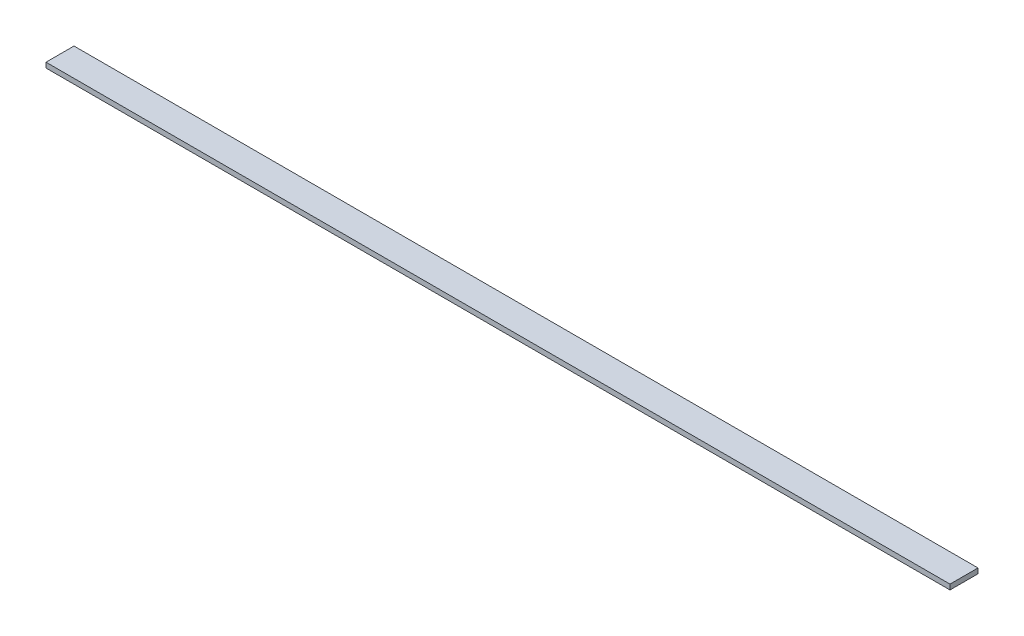
ISO-10303-21;
HEADER;
FILE_DESCRIPTION(('STEP AP214'),'2;1');
FILE_NAME('part.step','',(''),(''),'','','');
FILE_SCHEMA(('AUTOMOTIVE_DESIGN { 1 0 10303 214 1 1 1 1 }'));
ENDSEC;
DATA;
#1=APPLICATION_CONTEXT('core data for automotive mechanical design processes');
#2=APPLICATION_PROTOCOL_DEFINITION('international standard','automotive_design',2000,#1);
#3=PRODUCT_CONTEXT('',#1,'mechanical');
#4=PRODUCT('Part','Part','',(#3));
#5=PRODUCT_RELATED_PRODUCT_CATEGORY('part','',(#4));
#6=PRODUCT_DEFINITION_FORMATION('','',#4);
#7=PRODUCT_DEFINITION_CONTEXT('part definition',#1,'design');
#8=PRODUCT_DEFINITION('design','',#6,#7);
#9=PRODUCT_DEFINITION_SHAPE('','',#8);
#10=(LENGTH_UNIT() NAMED_UNIT(*) SI_UNIT(.MILLI.,.METRE.));
#11=(NAMED_UNIT(*) PLANE_ANGLE_UNIT() SI_UNIT($,.RADIAN.));
#12=(NAMED_UNIT(*) SI_UNIT($,.STERADIAN.) SOLID_ANGLE_UNIT());
#13=UNCERTAINTY_MEASURE_WITH_UNIT(LENGTH_MEASURE(1.E-05),#10,'distance_accuracy_value','');
#14=(GEOMETRIC_REPRESENTATION_CONTEXT(3) GLOBAL_UNCERTAINTY_ASSIGNED_CONTEXT((#13)) GLOBAL_UNIT_ASSIGNED_CONTEXT((#10,
#11,#12)) REPRESENTATION_CONTEXT('',''));
#15=CARTESIAN_POINT('',(0.,0.,0.));
#16=DIRECTION('',(0.,0.,1.));
#17=DIRECTION('',(1.,0.,0.));
#18=AXIS2_PLACEMENT_3D('',#15,#16,#17);
#19=CARTESIAN_POINT('',(0.,25.4,0.));
#20=DIRECTION('',(0.,0.,1.));
#21=DIRECTION('',(1.,0.,0.));
#22=AXIS2_PLACEMENT_3D('',#19,#20,#21);
#23=PLANE('',#22);
#24=DIRECTION('',(-1.,0.,0.));
#25=VECTOR('',#24,1.);
#26=CARTESIAN_POINT('',(0.,0.,0.));
#27=LINE('',#26,#25);
#28=CARTESIAN_POINT('',(4508.5,0.,0.));
#29=VERTEX_POINT('',#28);
#30=CARTESIAN_POINT('',(0.,0.,0.));
#31=VERTEX_POINT('',#30);
#32=EDGE_CURVE('E96',#29,#31,#27,.T.);
#33=ORIENTED_EDGE('',*,*,#32,.T.);
#34=DIRECTION('',(0.,-1.,0.));
#35=VECTOR('',#34,1.);
#36=CARTESIAN_POINT('',(0.,25.4,0.));
#37=LINE('',#36,#35);
#38=CARTESIAN_POINT('',(0.,25.4,0.));
#39=VERTEX_POINT('',#38);
#40=EDGE_CURVE('E11',#39,#31,#37,.T.);
#41=ORIENTED_EDGE('',*,*,#40,.F.);
#42=DIRECTION('',(-1.,0.,0.));
#43=VECTOR('',#42,1.);
#44=CARTESIAN_POINT('',(0.,25.4,0.));
#45=LINE('',#44,#43);
#46=CARTESIAN_POINT('',(4508.5,25.4,0.));
#47=VERTEX_POINT('',#46);
#48=EDGE_CURVE('E84',#47,#39,#45,.T.);
#49=ORIENTED_EDGE('',*,*,#48,.F.);
#50=DIRECTION('',(0.,-1.,0.));
#51=VECTOR('',#50,1.);
#52=CARTESIAN_POINT('',(4508.5,25.4,0.));
#53=LINE('',#52,#51);
#54=EDGE_CURVE('E92',#47,#29,#53,.T.);
#55=ORIENTED_EDGE('',*,*,#54,.T.);
#56=EDGE_LOOP('',(#33,#41,#49,#55));
#57=FACE_BOUND('',#56,.T.);
#58=ADVANCED_FACE('F33',(#57),#23,.F.);
#59=CARTESIAN_POINT('',(0.,25.4,0.));
#60=DIRECTION('',(1.,0.,0.));
#61=DIRECTION('',(0.,0.,-1.));
#62=AXIS2_PLACEMENT_3D('',#59,#60,#61);
#63=PLANE('',#62);
#64=DIRECTION('',(0.,0.,1.));
#65=VECTOR('',#64,1.);
#66=CARTESIAN_POINT('',(0.,0.,0.));
#67=LINE('',#66,#65);
#68=CARTESIAN_POINT('',(-4.87759943036386E-13,0.,139.7));
#69=VERTEX_POINT('',#68);
#70=EDGE_CURVE('E88',#31,#69,#67,.T.);
#71=ORIENTED_EDGE('',*,*,#70,.T.);
#72=DIRECTION('',(0.,-1.,0.));
#73=VECTOR('',#72,1.);
#74=CARTESIAN_POINT('',(-4.87759943036386E-13,25.4,139.7));
#75=LINE('',#74,#73);
#76=CARTESIAN_POINT('',(-4.87759943036386E-13,25.4,139.7));
#77=VERTEX_POINT('',#76);
#78=EDGE_CURVE('E41',#77,#69,#75,.T.);
#79=ORIENTED_EDGE('',*,*,#78,.F.);
#80=DIRECTION('',(0.,0.,1.));
#81=VECTOR('',#80,1.);
#82=CARTESIAN_POINT('',(0.,25.4,0.));
#83=LINE('',#82,#81);
#84=EDGE_CURVE('E79',#39,#77,#83,.T.);
#85=ORIENTED_EDGE('',*,*,#84,.F.);
#86=ORIENTED_EDGE('',*,*,#40,.T.);
#87=EDGE_LOOP('',(#71,#79,#85,#86));
#88=FACE_BOUND('',#87,.T.);
#89=ADVANCED_FACE('F87',(#88),#63,.F.);
#90=CARTESIAN_POINT('',(-4.87759943036386E-13,25.4,139.7));
#91=DIRECTION('',(0.,0.,-1.));
#92=DIRECTION('',(-1.,0.,0.));
#93=AXIS2_PLACEMENT_3D('',#90,#91,#92);
#94=PLANE('',#93);
#95=DIRECTION('',(1.,0.,0.));
#96=VECTOR('',#95,1.);
#97=CARTESIAN_POINT('',(-4.87759943036386E-13,0.,139.7));
#98=LINE('',#97,#96);
#99=CARTESIAN_POINT('',(4508.5,0.,139.7));
#100=VERTEX_POINT('',#99);
#101=EDGE_CURVE('E66',#69,#100,#98,.T.);
#102=ORIENTED_EDGE('',*,*,#101,.T.);
#103=DIRECTION('',(0.,-1.,0.));
#104=VECTOR('',#103,1.);
#105=CARTESIAN_POINT('',(4508.5,25.4,139.7));
#106=LINE('',#105,#104);
#107=CARTESIAN_POINT('',(4508.5,25.4,139.7));
#108=VERTEX_POINT('',#107);
#109=EDGE_CURVE('E89',#108,#100,#106,.T.);
#110=ORIENTED_EDGE('',*,*,#109,.F.);
#111=DIRECTION('',(1.,0.,0.));
#112=VECTOR('',#111,1.);
#113=CARTESIAN_POINT('',(-4.87759943036386E-13,25.4,139.7));
#114=LINE('',#113,#112);
#115=EDGE_CURVE('E82',#77,#108,#114,.T.);
#116=ORIENTED_EDGE('',*,*,#115,.F.);
#117=ORIENTED_EDGE('',*,*,#78,.T.);
#118=EDGE_LOOP('',(#102,#110,#116,#117));
#119=FACE_BOUND('',#118,.T.);
#120=ADVANCED_FACE('F90',(#119),#94,.F.);
#121=CARTESIAN_POINT('',(4508.5,25.4,0.));
#122=DIRECTION('',(-1.,0.,0.));
#123=DIRECTION('',(0.,0.,1.));
#124=AXIS2_PLACEMENT_3D('',#121,#122,#123);
#125=PLANE('',#124);
#126=DIRECTION('',(0.,0.,-1.));
#127=VECTOR('',#126,1.);
#128=CARTESIAN_POINT('',(4508.5,0.,0.));
#129=LINE('',#128,#127);
#130=EDGE_CURVE('E72',#100,#29,#129,.T.);
#131=ORIENTED_EDGE('',*,*,#130,.T.);
#132=ORIENTED_EDGE('',*,*,#54,.F.);
#133=DIRECTION('',(0.,0.,-1.));
#134=VECTOR('',#133,1.);
#135=CARTESIAN_POINT('',(4508.5,25.4,0.));
#136=LINE('',#135,#134);
#137=EDGE_CURVE('E49',#108,#47,#136,.T.);
#138=ORIENTED_EDGE('',*,*,#137,.F.);
#139=ORIENTED_EDGE('',*,*,#109,.T.);
#140=EDGE_LOOP('',(#131,#132,#138,#139));
#141=FACE_BOUND('',#140,.T.);
#142=ADVANCED_FACE('F103',(#141),#125,.F.);
#143=CARTESIAN_POINT('',(0.,25.4,0.));
#144=DIRECTION('',(0.,-1.,0.));
#145=DIRECTION('',(0.,0.,-1.));
#146=AXIS2_PLACEMENT_3D('',#143,#144,#145);
#147=PLANE('',#146);
#148=ORIENTED_EDGE('',*,*,#48,.T.);
#149=ORIENTED_EDGE('',*,*,#84,.T.);
#150=ORIENTED_EDGE('',*,*,#115,.T.);
#151=ORIENTED_EDGE('',*,*,#137,.T.);
#152=EDGE_LOOP('',(#148,#149,#150,#151));
#153=FACE_BOUND('',#152,.T.);
#154=ADVANCED_FACE('F80',(#153),#147,.F.);
#155=CARTESIAN_POINT('',(0.,0.,0.));
#156=DIRECTION('',(0.,-1.,0.));
#157=DIRECTION('',(0.,0.,-1.));
#158=AXIS2_PLACEMENT_3D('',#155,#156,#157);
#159=PLANE('',#158);
#160=ORIENTED_EDGE('',*,*,#32,.F.);
#161=ORIENTED_EDGE('',*,*,#130,.F.);
#162=ORIENTED_EDGE('',*,*,#101,.F.);
#163=ORIENTED_EDGE('',*,*,#70,.F.);
#164=EDGE_LOOP('',(#160,#161,#162,#163));
#165=FACE_BOUND('',#164,.T.);
#166=ADVANCED_FACE('F106',(#165),#159,.T.);
#167=CLOSED_SHELL('',(#58,#89,#120,#142,#154,#166));
#168=MANIFOLD_SOLID_BREP('B2',#167);
#169=ADVANCED_BREP_SHAPE_REPRESENTATION('',(#18,#168),#14);
#170=SHAPE_DEFINITION_REPRESENTATION(#9,#169);
ENDSEC;
END-ISO-10303-21;
